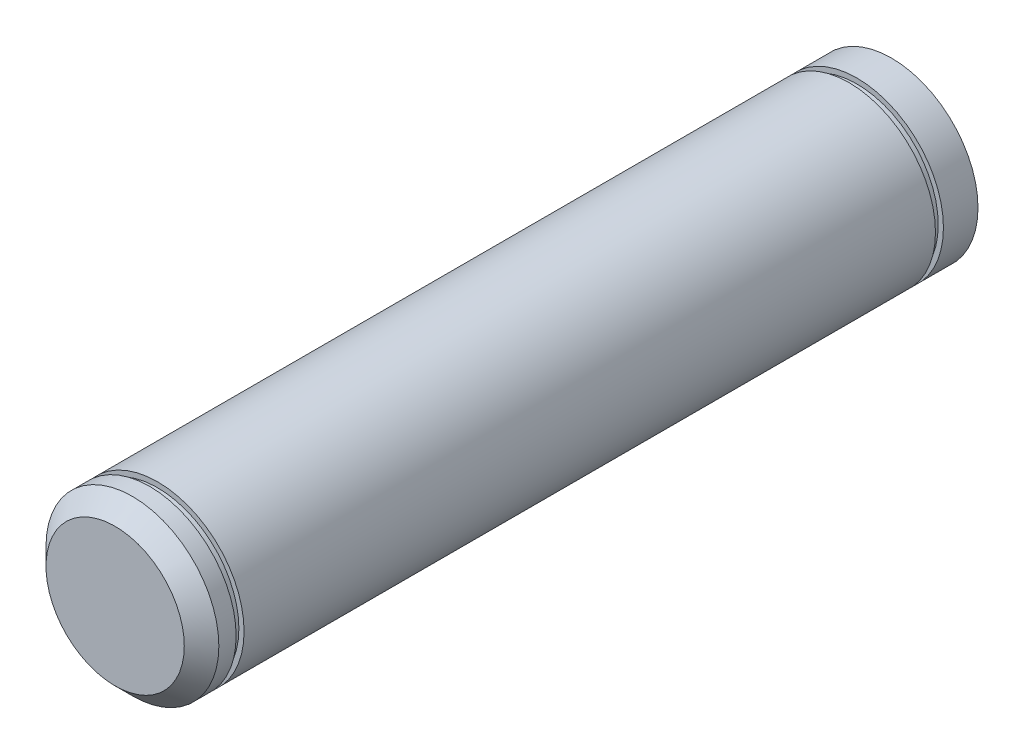
ISO-10303-21;
HEADER;
FILE_DESCRIPTION(('STEP AP214'),'2;1');
FILE_NAME('part.step','',(''),(''),'','','');
FILE_SCHEMA(('AUTOMOTIVE_DESIGN { 1 0 10303 214 1 1 1 1 }'));
ENDSEC;
DATA;
#1=APPLICATION_CONTEXT('core data for automotive mechanical design processes');
#2=APPLICATION_PROTOCOL_DEFINITION('international standard','automotive_design',2000,#1);
#3=PRODUCT_CONTEXT('',#1,'mechanical');
#4=PRODUCT('Part','Part','',(#3));
#5=PRODUCT_RELATED_PRODUCT_CATEGORY('part','',(#4));
#6=PRODUCT_DEFINITION_FORMATION('','',#4);
#7=PRODUCT_DEFINITION_CONTEXT('part definition',#1,'design');
#8=PRODUCT_DEFINITION('design','',#6,#7);
#9=PRODUCT_DEFINITION_SHAPE('','',#8);
#10=(LENGTH_UNIT() NAMED_UNIT(*) SI_UNIT(.MILLI.,.METRE.));
#11=(NAMED_UNIT(*) PLANE_ANGLE_UNIT() SI_UNIT($,.RADIAN.));
#12=(NAMED_UNIT(*) SI_UNIT($,.STERADIAN.) SOLID_ANGLE_UNIT());
#13=UNCERTAINTY_MEASURE_WITH_UNIT(LENGTH_MEASURE(1.E-05),#10,'distance_accuracy_value','');
#14=(GEOMETRIC_REPRESENTATION_CONTEXT(3) GLOBAL_UNCERTAINTY_ASSIGNED_CONTEXT((#13)) GLOBAL_UNIT_ASSIGNED_CONTEXT((#10,
#11,#12)) REPRESENTATION_CONTEXT('',''));
#15=CARTESIAN_POINT('',(0.,0.,0.));
#16=DIRECTION('',(0.,0.,1.));
#17=DIRECTION('',(1.,0.,0.));
#18=AXIS2_PLACEMENT_3D('',#15,#16,#17);
#19=CARTESIAN_POINT('',(0.,0.,304.8));
#20=DIRECTION('',(0.,0.,-1.));
#21=DIRECTION('',(-1.,0.,0.));
#22=AXIS2_PLACEMENT_3D('',#19,#20,#21);
#23=CYLINDRICAL_SURFACE('',#22,12.7);
#24=CARTESIAN_POINT('',(0.,0.,298.5516));
#25=DIRECTION('',(0.,0.,1.));
#26=DIRECTION('',(1.,0.,0.));
#27=AXIS2_PLACEMENT_3D('',#24,#25,#26);
#28=CIRCLE('',#27,12.7);
#29=CARTESIAN_POINT('',(12.7,0.,298.5516));
#30=VERTEX_POINT('',#29);
#31=EDGE_CURVE('E49',#30,#30,#28,.T.);
#32=ORIENTED_EDGE('',*,*,#31,.F.);
#33=EDGE_LOOP('',(#32));
#34=FACE_BOUND('',#33,.T.);
#35=CARTESIAN_POINT('',(0.,0.,196.9484));
#36=DIRECTION('',(0.,0.,1.));
#37=DIRECTION('',(1.,0.,0.));
#38=AXIS2_PLACEMENT_3D('',#35,#36,#37);
#39=CIRCLE('',#38,12.7);
#40=CARTESIAN_POINT('',(12.7,0.,196.9484));
#41=VERTEX_POINT('',#40);
#42=EDGE_CURVE('E61',#41,#41,#39,.T.);
#43=ORIENTED_EDGE('',*,*,#42,.T.);
#44=EDGE_LOOP('',(#43));
#45=FACE_BOUND('',#44,.T.);
#46=ADVANCED_FACE('F34',(#34,#45),#23,.T.);
#47=CARTESIAN_POINT('',(0.,0.,299.72));
#48=DIRECTION('',(0.,0.,1.));
#49=DIRECTION('',(1.,0.,0.));
#50=AXIS2_PLACEMENT_3D('',#47,#48,#49);
#51=CIRCLE('',#50,12.7);
#52=CARTESIAN_POINT('',(12.7,0.,299.72));
#53=VERTEX_POINT('',#52);
#54=EDGE_CURVE('E52',#53,#53,#51,.T.);
#55=ORIENTED_EDGE('',*,*,#54,.T.);
#56=EDGE_LOOP('',(#55));
#57=FACE_BOUND('',#56,.T.);
#58=CARTESIAN_POINT('',(0.,0.,302.26));
#59=DIRECTION('',(0.,0.,1.));
#60=DIRECTION('',(1.,0.,0.));
#61=AXIS2_PLACEMENT_3D('',#58,#59,#60);
#62=CIRCLE('',#61,12.7);
#63=CARTESIAN_POINT('',(12.7,0.,302.26));
#64=VERTEX_POINT('',#63);
#65=EDGE_CURVE('E41',#64,#64,#62,.F.);
#66=ORIENTED_EDGE('',*,*,#65,.T.);
#67=EDGE_LOOP('',(#66));
#68=FACE_BOUND('',#67,.T.);
#69=ADVANCED_FACE('F97',(#57,#68),#23,.T.);
#70=CARTESIAN_POINT('',(0.,0.,304.8));
#71=DIRECTION('',(0.,0.,1.));
#72=DIRECTION('',(1.,0.,0.));
#73=AXIS2_PLACEMENT_3D('',#70,#71,#72);
#74=PLANE('',#73);
#75=CARTESIAN_POINT('',(0.,0.,304.8));
#76=DIRECTION('',(0.,0.,1.));
#77=DIRECTION('',(1.,0.,0.));
#78=AXIS2_PLACEMENT_3D('',#75,#76,#77);
#79=CIRCLE('',#78,10.1600000000003);
#80=CARTESIAN_POINT('',(10.1600000000003,0.,304.8));
#81=VERTEX_POINT('',#80);
#82=EDGE_CURVE('E10',#81,#81,#79,.T.);
#83=ORIENTED_EDGE('',*,*,#82,.T.);
#84=EDGE_LOOP('',(#83));
#85=FACE_BOUND('',#84,.T.);
#86=ADVANCED_FACE('F103',(#85),#74,.T.);
#87=CARTESIAN_POINT('',(0.,0.,304.8));
#88=DIRECTION('',(0.,0.,-1.));
#89=DIRECTION('',(-1.,0.,0.));
#90=AXIS2_PLACEMENT_3D('',#87,#88,#89);
#91=CONICAL_SURFACE('',#90,10.1600000000003,0.785398163397451);
#92=ORIENTED_EDGE('',*,*,#65,.F.);
#93=EDGE_LOOP('',(#92));
#94=FACE_BOUND('',#93,.T.);
#95=ORIENTED_EDGE('',*,*,#82,.F.);
#96=EDGE_LOOP('',(#95));
#97=FACE_BOUND('',#96,.T.);
#98=ADVANCED_FACE('F36',(#94,#97),#91,.T.);
#99=CARTESIAN_POINT('',(0.,0.,298.5516));
#100=DIRECTION('',(0.,0.,1.));
#101=DIRECTION('',(1.,0.,0.));
#102=AXIS2_PLACEMENT_3D('',#99,#100,#101);
#103=PLANE('',#102);
#104=CARTESIAN_POINT('',(0.,0.,298.5516));
#105=DIRECTION('',(0.,0.,1.));
#106=DIRECTION('',(1.,0.,0.));
#107=AXIS2_PLACEMENT_3D('',#104,#105,#106);
#108=CIRCLE('',#107,11.938);
#109=CARTESIAN_POINT('',(11.938,0.,298.5516));
#110=VERTEX_POINT('',#109);
#111=EDGE_CURVE('E55',#110,#110,#108,.T.);
#112=ORIENTED_EDGE('',*,*,#111,.F.);
#113=EDGE_LOOP('',(#112));
#114=FACE_BOUND('',#113,.T.);
#115=ORIENTED_EDGE('',*,*,#31,.T.);
#116=EDGE_LOOP('',(#115));
#117=FACE_BOUND('',#116,.T.);
#118=ADVANCED_FACE('F127',(#114,#117),#103,.T.);
#119=CARTESIAN_POINT('',(0.,0.,299.72));
#120=DIRECTION('',(0.,0.,1.));
#121=DIRECTION('',(1.,0.,0.));
#122=AXIS2_PLACEMENT_3D('',#119,#120,#121);
#123=PLANE('',#122);
#124=CARTESIAN_POINT('',(0.,0.,299.72));
#125=DIRECTION('',(0.,0.,1.));
#126=DIRECTION('',(1.,0.,0.));
#127=AXIS2_PLACEMENT_3D('',#124,#125,#126);
#128=CIRCLE('',#127,11.938);
#129=CARTESIAN_POINT('',(11.938,0.,299.72));
#130=VERTEX_POINT('',#129);
#131=EDGE_CURVE('E58',#130,#130,#128,.T.);
#132=ORIENTED_EDGE('',*,*,#131,.T.);
#133=EDGE_LOOP('',(#132));
#134=FACE_BOUND('',#133,.T.);
#135=ORIENTED_EDGE('',*,*,#54,.F.);
#136=EDGE_LOOP('',(#135));
#137=FACE_BOUND('',#136,.T.);
#138=ADVANCED_FACE('F121',(#134,#137),#123,.F.);
#139=CARTESIAN_POINT('',(0.,0.,298.5516));
#140=DIRECTION('',(0.,0.,1.));
#141=DIRECTION('',(1.,0.,0.));
#142=AXIS2_PLACEMENT_3D('',#139,#140,#141);
#143=CYLINDRICAL_SURFACE('',#142,11.938);
#144=ORIENTED_EDGE('',*,*,#111,.T.);
#145=EDGE_LOOP('',(#144));
#146=FACE_BOUND('',#145,.T.);
#147=ORIENTED_EDGE('',*,*,#131,.F.);
#148=EDGE_LOOP('',(#147));
#149=FACE_BOUND('',#148,.T.);
#150=ADVANCED_FACE('F92',(#146,#149),#143,.T.);
#151=CARTESIAN_POINT('',(0.,0.,196.9484));
#152=DIRECTION('',(0.,0.,-1.));
#153=DIRECTION('',(1.,0.,0.));
#154=AXIS2_PLACEMENT_3D('',#151,#152,#153);
#155=PLANE('',#154);
#156=ORIENTED_EDGE('',*,*,#42,.F.);
#157=EDGE_LOOP('',(#156));
#158=FACE_BOUND('',#157,.T.);
#159=CARTESIAN_POINT('',(0.,0.,196.9484));
#160=DIRECTION('',(0.,0.,1.));
#161=DIRECTION('',(1.,0.,0.));
#162=AXIS2_PLACEMENT_3D('',#159,#160,#161);
#163=CIRCLE('',#162,11.938);
#164=CARTESIAN_POINT('',(11.938,0.,196.9484));
#165=VERTEX_POINT('',#164);
#166=EDGE_CURVE('E67',#165,#165,#163,.T.);
#167=ORIENTED_EDGE('',*,*,#166,.T.);
#168=EDGE_LOOP('',(#167));
#169=FACE_BOUND('',#168,.T.);
#170=ADVANCED_FACE('F76',(#158,#169),#155,.T.);
#171=CARTESIAN_POINT('',(0.,0.,195.78));
#172=DIRECTION('',(0.,0.,-1.));
#173=DIRECTION('',(1.,0.,0.));
#174=AXIS2_PLACEMENT_3D('',#171,#172,#173);
#175=PLANE('',#174);
#176=CARTESIAN_POINT('',(0.,0.,195.78));
#177=DIRECTION('',(0.,0.,1.));
#178=DIRECTION('',(1.,0.,0.));
#179=AXIS2_PLACEMENT_3D('',#176,#177,#178);
#180=CIRCLE('',#179,12.7);
#181=CARTESIAN_POINT('',(12.7,0.,195.78));
#182=VERTEX_POINT('',#181);
#183=EDGE_CURVE('E64',#182,#182,#180,.T.);
#184=ORIENTED_EDGE('',*,*,#183,.T.);
#185=EDGE_LOOP('',(#184));
#186=FACE_BOUND('',#185,.T.);
#187=CARTESIAN_POINT('',(0.,0.,195.78));
#188=DIRECTION('',(0.,0.,1.));
#189=DIRECTION('',(1.,0.,0.));
#190=AXIS2_PLACEMENT_3D('',#187,#188,#189);
#191=CIRCLE('',#190,11.938);
#192=CARTESIAN_POINT('',(11.938,0.,195.78));
#193=VERTEX_POINT('',#192);
#194=EDGE_CURVE('E70',#193,#193,#191,.T.);
#195=ORIENTED_EDGE('',*,*,#194,.F.);
#196=EDGE_LOOP('',(#195));
#197=FACE_BOUND('',#196,.T.);
#198=ADVANCED_FACE('F82',(#186,#197),#175,.F.);
#199=CARTESIAN_POINT('',(0.,0.,196.9484));
#200=DIRECTION('',(0.,0.,-1.));
#201=DIRECTION('',(-1.,0.,0.));
#202=AXIS2_PLACEMENT_3D('',#199,#200,#201);
#203=CYLINDRICAL_SURFACE('',#202,11.938);
#204=ORIENTED_EDGE('',*,*,#166,.F.);
#205=EDGE_LOOP('',(#204));
#206=FACE_BOUND('',#205,.T.);
#207=ORIENTED_EDGE('',*,*,#194,.T.);
#208=EDGE_LOOP('',(#207));
#209=FACE_BOUND('',#208,.T.);
#210=ADVANCED_FACE('F78',(#206,#209),#203,.T.);
#211=CARTESIAN_POINT('',(0.,0.,190.7));
#212=DIRECTION('',(0.,0.,1.));
#213=DIRECTION('',(1.,0.,0.));
#214=AXIS2_PLACEMENT_3D('',#211,#212,#213);
#215=PLANE('',#214);
#216=CARTESIAN_POINT('',(0.,0.,190.7));
#217=DIRECTION('',(0.,0.,1.));
#218=DIRECTION('',(1.,0.,0.));
#219=AXIS2_PLACEMENT_3D('',#216,#217,#218);
#220=CIRCLE('',#219,12.7);
#221=CARTESIAN_POINT('',(12.7,0.,190.7));
#222=VERTEX_POINT('',#221);
#223=EDGE_CURVE('E45',#222,#222,#220,.T.);
#224=ORIENTED_EDGE('',*,*,#223,.F.);
#225=EDGE_LOOP('',(#224));
#226=FACE_BOUND('',#225,.T.);
#227=ADVANCED_FACE('F81',(#226),#215,.F.);
#228=ORIENTED_EDGE('',*,*,#183,.F.);
#229=EDGE_LOOP('',(#228));
#230=FACE_BOUND('',#229,.T.);
#231=ORIENTED_EDGE('',*,*,#223,.T.);
#232=EDGE_LOOP('',(#231));
#233=FACE_BOUND('',#232,.T.);
#234=ADVANCED_FACE('F99',(#230,#233),#23,.T.);
#235=CLOSED_SHELL('',(#46,#69,#86,#98,#118,#138,#150,#170,#198,#210,#227,#234));
#236=MANIFOLD_SOLID_BREP('B2',#235);
#237=ADVANCED_BREP_SHAPE_REPRESENTATION('',(#18,#236),#14);
#238=SHAPE_DEFINITION_REPRESENTATION(#9,#237);
ENDSEC;
END-ISO-10303-21;
